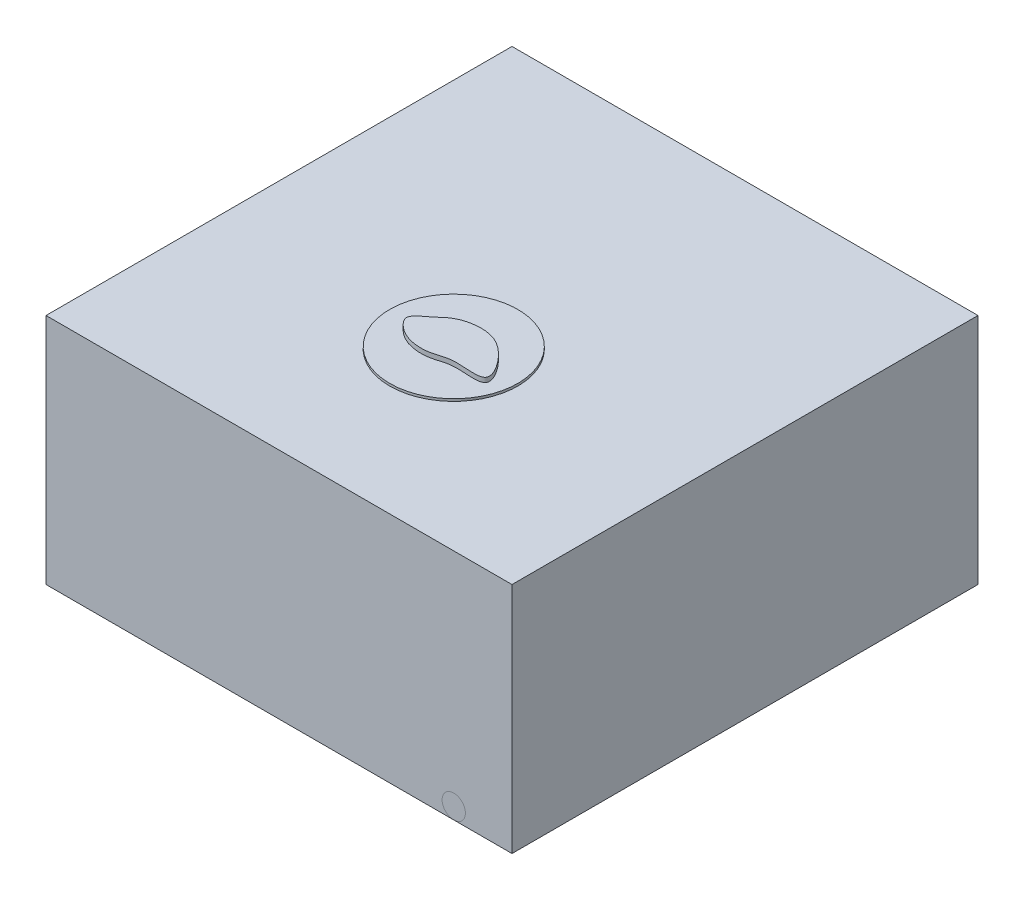
ISO-10303-21;
HEADER;
FILE_DESCRIPTION(('STEP AP214'),'2;1');
FILE_NAME('part.step','',(''),(''),'','','');
FILE_SCHEMA(('AUTOMOTIVE_DESIGN { 1 0 10303 214 1 1 1 1 }'));
ENDSEC;
DATA;
#1=APPLICATION_CONTEXT('core data for automotive mechanical design processes');
#2=APPLICATION_PROTOCOL_DEFINITION('international standard','automotive_design',2000,#1);
#3=PRODUCT_CONTEXT('',#1,'mechanical');
#4=PRODUCT('Part','Part','',(#3));
#5=PRODUCT_RELATED_PRODUCT_CATEGORY('part','',(#4));
#6=PRODUCT_DEFINITION_FORMATION('','',#4);
#7=PRODUCT_DEFINITION_CONTEXT('part definition',#1,'design');
#8=PRODUCT_DEFINITION('design','',#6,#7);
#9=PRODUCT_DEFINITION_SHAPE('','',#8);
#10=(LENGTH_UNIT() NAMED_UNIT(*) SI_UNIT(.MILLI.,.METRE.));
#11=(NAMED_UNIT(*) PLANE_ANGLE_UNIT() SI_UNIT($,.RADIAN.));
#12=(NAMED_UNIT(*) SI_UNIT($,.STERADIAN.) SOLID_ANGLE_UNIT());
#13=UNCERTAINTY_MEASURE_WITH_UNIT(LENGTH_MEASURE(1.E-05),#10,'distance_accuracy_value','');
#14=(GEOMETRIC_REPRESENTATION_CONTEXT(3) GLOBAL_UNCERTAINTY_ASSIGNED_CONTEXT((#13)) GLOBAL_UNIT_ASSIGNED_CONTEXT((#10,
#11,#12)) REPRESENTATION_CONTEXT('',''));
#15=CARTESIAN_POINT('',(0.,0.,0.));
#16=DIRECTION('',(0.,0.,1.));
#17=DIRECTION('',(1.,0.,0.));
#18=AXIS2_PLACEMENT_3D('',#15,#16,#17);
#19=CARTESIAN_POINT('',(-1.32978682457797,5.3,12.0470966404881));
#20=CARTESIAN_POINT('',(-1.56949938233388,5.3,12.2405123536894));
#21=CARTESIAN_POINT('',(-2.08614424851907,5.3,12.5391697720833));
#22=CARTESIAN_POINT('',(-1.58643209411403,5.3,13.1168891119311));
#23=CARTESIAN_POINT('',(-0.99479110722871,5.3,13.4609601521511));
#24=CARTESIAN_POINT('',(-0.122057096544853,5.3,13.5063472457396));
#25=CARTESIAN_POINT('',(0.780549472015395,5.3,13.1044677868928));
#26=CARTESIAN_POINT('',(2.65290980881673,5.3,13.5718372621998));
#27=CARTESIAN_POINT('',(1.37260667116618,5.3,11.7465735610997));
#28=CARTESIAN_POINT('',(0.251281573482777,5.3,11.3225744749199));
#29=CARTESIAN_POINT('',(-0.824147776626976,5.3,11.5489578340658));
#30=CARTESIAN_POINT('',(-1.19634203116918,5.3,11.9394246848268));
#31=CARTESIAN_POINT('',(-1.32978682457797,5.3,12.0470966404881));
#32=B_SPLINE_CURVE_WITH_KNOTS('',3,(#19,#20,#21,#22,#23,#24,#25,#26,#27,#28,#29,#30,#31),
.UNSPECIFIED.,.T.,.F.,(4,1,1,1,1,1,1,1,1,1,4),(0.,0.0890314863366276,0.133435272323839,
0.204833870138696,0.315562123210451,0.38661889368764,0.538438655581061,0.696738525235763,
0.817182112999442,0.95043735542146,1.),.UNSPECIFIED.);
#33=DIRECTION('',(0.,-1.,0.));
#34=VECTOR('',#33,1.);
#35=SURFACE_OF_LINEAR_EXTRUSION('',#32,#34);
#36=CARTESIAN_POINT('',(-1.32978682457797,5.3,12.0470966404881));
#37=VERTEX_POINT('',#36);
#38=EDGE_CURVE('E11',#37,#37,#32,.T.);
#39=ORIENTED_EDGE('',*,*,#38,.F.);
#40=EDGE_LOOP('',(#39));
#41=FACE_BOUND('',#40,.T.);
#42=CARTESIAN_POINT('',(-1.32978682457797,5.,12.0470966404881));
#43=CARTESIAN_POINT('',(-1.56949938233388,5.,12.2405123536894));
#44=CARTESIAN_POINT('',(-2.08614424851907,5.,12.5391697720833));
#45=CARTESIAN_POINT('',(-1.58643209411403,5.,13.1168891119311));
#46=CARTESIAN_POINT('',(-0.99479110722871,5.,13.4609601521511));
#47=CARTESIAN_POINT('',(-0.122057096544853,5.,13.5063472457396));
#48=CARTESIAN_POINT('',(0.780549472015395,5.,13.1044677868928));
#49=CARTESIAN_POINT('',(2.65290980881673,5.,13.5718372621998));
#50=CARTESIAN_POINT('',(1.37260667116618,5.,11.7465735610997));
#51=CARTESIAN_POINT('',(0.251281573482777,5.,11.3225744749199));
#52=CARTESIAN_POINT('',(-0.824147776626976,5.,11.5489578340658));
#53=CARTESIAN_POINT('',(-1.19634203116918,5.,11.9394246848268));
#54=CARTESIAN_POINT('',(-1.32978682457797,5.,12.0470966404881));
#55=B_SPLINE_CURVE_WITH_KNOTS('',3,(#42,#43,#44,#45,#46,#47,#48,#49,#50,#51,#52,#53,#54),
.UNSPECIFIED.,.T.,.F.,(4,1,1,1,1,1,1,1,1,1,4),(0.,0.0890314863366276,0.133435272323839,
0.204833870138696,0.315562123210451,0.38661889368764,0.538438655581061,0.696738525235763,
0.817182112999442,0.95043735542146,1.),.UNSPECIFIED.);
#56=CARTESIAN_POINT('',(-1.32978682457797,5.,12.0470966404881));
#57=VERTEX_POINT('',#56);
#58=EDGE_CURVE('E45',#57,#57,#55,.T.);
#59=ORIENTED_EDGE('',*,*,#58,.T.);
#60=EDGE_LOOP('',(#59));
#61=FACE_BOUND('',#60,.T.);
#62=ADVANCED_FACE('F41',(#41,#61),#35,.F.);
#63=CARTESIAN_POINT('',(1.81422588975815,5.3,13.257386496687));
#64=DIRECTION('',(0.,-1.,0.));
#65=DIRECTION('',(0.,0.,-1.));
#66=AXIS2_PLACEMENT_3D('',#63,#64,#65);
#67=PLANE('',#66);
#68=ORIENTED_EDGE('',*,*,#38,.T.);
#69=EDGE_LOOP('',(#68));
#70=FACE_BOUND('',#69,.T.);
#71=ADVANCED_FACE('F64',(#70),#67,.F.);
#72=CARTESIAN_POINT('',(1.81422588975815,5.,13.257386496687));
#73=DIRECTION('',(0.,-1.,0.));
#74=DIRECTION('',(0.,0.,-1.));
#75=AXIS2_PLACEMENT_3D('',#72,#73,#74);
#76=PLANE('',#75);
#77=ORIENTED_EDGE('',*,*,#58,.F.);
#78=EDGE_LOOP('',(#77));
#79=FACE_BOUND('',#78,.T.);
#80=ADVANCED_FACE('F62',(#79),#76,.T.);
#81=CLOSED_SHELL('',(#62,#71,#80));
#82=MANIFOLD_SOLID_BREP('B2',#81);
#83=CARTESIAN_POINT('',(0.5,5.,12.5));
#84=DIRECTION('',(0.,1.,0.));
#85=DIRECTION('',(0.,0.,1.));
#86=AXIS2_PLACEMENT_3D('',#83,#84,#85);
#87=CYLINDRICAL_SURFACE('',#86,0.00500000000000103);
#88=CARTESIAN_POINT('',(0.5,5.,12.5));
#89=DIRECTION('',(0.,-1.,0.));
#90=DIRECTION('',(0.,0.,1.));
#91=AXIS2_PLACEMENT_3D('',#88,#89,#90);
#92=CIRCLE('',#91,0.00500000000000103);
#93=CARTESIAN_POINT('',(0.5,5.,12.505));
#94=VERTEX_POINT('',#93);
#95=EDGE_CURVE('E40',#94,#94,#92,.T.);
#96=ORIENTED_EDGE('',*,*,#95,.F.);
#97=EDGE_LOOP('',(#96));
#98=FACE_BOUND('',#97,.T.);
#99=CARTESIAN_POINT('',(0.5,5.1,12.5));
#100=DIRECTION('',(0.,-1.,0.));
#101=DIRECTION('',(0.,0.,1.));
#102=AXIS2_PLACEMENT_3D('',#99,#100,#101);
#103=CIRCLE('',#102,0.00500000000000103);
#104=CARTESIAN_POINT('',(0.5,5.1,12.505));
#105=VERTEX_POINT('',#104);
#106=EDGE_CURVE('E103',#105,#105,#103,.T.);
#107=ORIENTED_EDGE('',*,*,#106,.T.);
#108=EDGE_LOOP('',(#107));
#109=FACE_BOUND('',#108,.T.);
#110=ADVANCED_FACE('F100',(#98,#109),#87,.T.);
#111=CARTESIAN_POINT('',(0.5,5.,12.5));
#112=DIRECTION('',(0.,1.,0.));
#113=DIRECTION('',(0.,0.,1.));
#114=AXIS2_PLACEMENT_3D('',#111,#112,#113);
#115=PLANE('',#114);
#116=ORIENTED_EDGE('',*,*,#95,.T.);
#117=EDGE_LOOP('',(#116));
#118=FACE_BOUND('',#117,.T.);
#119=ADVANCED_FACE('F115',(#118),#115,.F.);
#120=CARTESIAN_POINT('',(0.5,5.1,12.5));
#121=DIRECTION('',(0.,1.,0.));
#122=DIRECTION('',(0.,0.,1.));
#123=AXIS2_PLACEMENT_3D('',#120,#121,#122);
#124=PLANE('',#123);
#125=ORIENTED_EDGE('',*,*,#106,.F.);
#126=EDGE_LOOP('',(#125));
#127=FACE_BOUND('',#126,.T.);
#128=ADVANCED_FACE('F113',(#127),#124,.T.);
#129=CLOSED_SHELL('',(#110,#119,#128));
#130=MANIFOLD_SOLID_BREP('B6_NOT_SHOWN',#129);
#131=CARTESIAN_POINT('',(0.499999999999998,5.,12.));
#132=DIRECTION('',(0.,1.,0.));
#133=DIRECTION('',(0.,0.,1.));
#134=AXIS2_PLACEMENT_3D('',#131,#132,#133);
#135=CYLINDRICAL_SURFACE('',#134,0.00499999999999896);
#136=CARTESIAN_POINT('',(0.499999999999998,5.,12.));
#137=DIRECTION('',(0.,-1.,0.));
#138=DIRECTION('',(0.,0.,1.));
#139=AXIS2_PLACEMENT_3D('',#136,#137,#138);
#140=CIRCLE('',#139,0.00499999999999896);
#141=CARTESIAN_POINT('',(0.499999999999998,5.,12.005));
#142=VERTEX_POINT('',#141);
#143=EDGE_CURVE('E99',#142,#142,#140,.T.);
#144=ORIENTED_EDGE('',*,*,#143,.F.);
#145=EDGE_LOOP('',(#144));
#146=FACE_BOUND('',#145,.T.);
#147=CARTESIAN_POINT('',(0.499999999999998,5.1,12.));
#148=DIRECTION('',(0.,-1.,0.));
#149=DIRECTION('',(0.,0.,1.));
#150=AXIS2_PLACEMENT_3D('',#147,#148,#149);
#151=CIRCLE('',#150,0.00499999999999896);
#152=CARTESIAN_POINT('',(0.499999999999998,5.1,12.005));
#153=VERTEX_POINT('',#152);
#154=EDGE_CURVE('E151',#153,#153,#151,.T.);
#155=ORIENTED_EDGE('',*,*,#154,.T.);
#156=EDGE_LOOP('',(#155));
#157=FACE_BOUND('',#156,.T.);
#158=ADVANCED_FACE('F148',(#146,#157),#135,.T.);
#159=CARTESIAN_POINT('',(0.499999999999998,5.,12.));
#160=DIRECTION('',(0.,1.,0.));
#161=DIRECTION('',(0.,0.,1.));
#162=AXIS2_PLACEMENT_3D('',#159,#160,#161);
#163=PLANE('',#162);
#164=ORIENTED_EDGE('',*,*,#143,.T.);
#165=EDGE_LOOP('',(#164));
#166=FACE_BOUND('',#165,.T.);
#167=ADVANCED_FACE('F163',(#166),#163,.F.);
#168=CARTESIAN_POINT('',(0.499999999999998,5.1,12.));
#169=DIRECTION('',(0.,1.,0.));
#170=DIRECTION('',(0.,0.,1.));
#171=AXIS2_PLACEMENT_3D('',#168,#169,#170);
#172=PLANE('',#171);
#173=ORIENTED_EDGE('',*,*,#154,.F.);
#174=EDGE_LOOP('',(#173));
#175=FACE_BOUND('',#174,.T.);
#176=ADVANCED_FACE('F161',(#175),#172,.T.);
#177=CLOSED_SHELL('',(#158,#167,#176));
#178=MANIFOLD_SOLID_BREP('B35_NOT_SHOWN',#177);
#179=CARTESIAN_POINT('',(0.499999999999998,5.,13.));
#180=DIRECTION('',(0.,1.,0.));
#181=DIRECTION('',(0.,0.,1.));
#182=AXIS2_PLACEMENT_3D('',#179,#180,#181);
#183=CYLINDRICAL_SURFACE('',#182,0.00500000000000103);
#184=CARTESIAN_POINT('',(0.499999999999998,5.,13.));
#185=DIRECTION('',(0.,-1.,0.));
#186=DIRECTION('',(0.,0.,-1.));
#187=AXIS2_PLACEMENT_3D('',#184,#185,#186);
#188=CIRCLE('',#187,0.00500000000000103);
#189=CARTESIAN_POINT('',(0.499999999999998,5.,12.995));
#190=VERTEX_POINT('',#189);
#191=EDGE_CURVE('E147',#190,#190,#188,.T.);
#192=ORIENTED_EDGE('',*,*,#191,.F.);
#193=EDGE_LOOP('',(#192));
#194=FACE_BOUND('',#193,.T.);
#195=CARTESIAN_POINT('',(0.499999999999998,5.1,13.));
#196=DIRECTION('',(0.,-1.,0.));
#197=DIRECTION('',(0.,0.,-1.));
#198=AXIS2_PLACEMENT_3D('',#195,#196,#197);
#199=CIRCLE('',#198,0.00500000000000103);
#200=CARTESIAN_POINT('',(0.499999999999998,5.1,12.995));
#201=VERTEX_POINT('',#200);
#202=EDGE_CURVE('E199',#201,#201,#199,.T.);
#203=ORIENTED_EDGE('',*,*,#202,.T.);
#204=EDGE_LOOP('',(#203));
#205=FACE_BOUND('',#204,.T.);
#206=ADVANCED_FACE('F196',(#194,#205),#183,.T.);
#207=CARTESIAN_POINT('',(0.499999999999998,5.,13.));
#208=DIRECTION('',(0.,-1.,0.));
#209=DIRECTION('',(0.,0.,-1.));
#210=AXIS2_PLACEMENT_3D('',#207,#208,#209);
#211=PLANE('',#210);
#212=ORIENTED_EDGE('',*,*,#191,.T.);
#213=EDGE_LOOP('',(#212));
#214=FACE_BOUND('',#213,.T.);
#215=ADVANCED_FACE('F211',(#214),#211,.T.);
#216=CARTESIAN_POINT('',(0.499999999999998,5.1,13.));
#217=DIRECTION('',(0.,-1.,0.));
#218=DIRECTION('',(0.,0.,-1.));
#219=AXIS2_PLACEMENT_3D('',#216,#217,#218);
#220=PLANE('',#219);
#221=ORIENTED_EDGE('',*,*,#202,.F.);
#222=EDGE_LOOP('',(#221));
#223=FACE_BOUND('',#222,.T.);
#224=ADVANCED_FACE('F209',(#223),#220,.F.);
#225=CLOSED_SHELL('',(#206,#215,#224));
#226=MANIFOLD_SOLID_BREP('B94_NOT_SHOWN',#225);
#227=CARTESIAN_POINT('',(0.,5.,13.));
#228=DIRECTION('',(0.,1.,0.));
#229=DIRECTION('',(0.,0.,1.));
#230=AXIS2_PLACEMENT_3D('',#227,#228,#229);
#231=CYLINDRICAL_SURFACE('',#230,0.00500000000000099);
#232=CARTESIAN_POINT('',(0.,5.,13.));
#233=DIRECTION('',(0.,-1.,0.));
#234=DIRECTION('',(0.,0.,1.));
#235=AXIS2_PLACEMENT_3D('',#232,#233,#234);
#236=CIRCLE('',#235,0.00500000000000099);
#237=CARTESIAN_POINT('',(0.,5.,13.005));
#238=VERTEX_POINT('',#237);
#239=EDGE_CURVE('E195',#238,#238,#236,.T.);
#240=ORIENTED_EDGE('',*,*,#239,.F.);
#241=EDGE_LOOP('',(#240));
#242=FACE_BOUND('',#241,.T.);
#243=CARTESIAN_POINT('',(0.,5.1,13.));
#244=DIRECTION('',(0.,-1.,0.));
#245=DIRECTION('',(0.,0.,1.));
#246=AXIS2_PLACEMENT_3D('',#243,#244,#245);
#247=CIRCLE('',#246,0.00500000000000099);
#248=CARTESIAN_POINT('',(0.,5.1,13.005));
#249=VERTEX_POINT('',#248);
#250=EDGE_CURVE('E247',#249,#249,#247,.T.);
#251=ORIENTED_EDGE('',*,*,#250,.T.);
#252=EDGE_LOOP('',(#251));
#253=FACE_BOUND('',#252,.T.);
#254=ADVANCED_FACE('F244',(#242,#253),#231,.T.);
#255=CARTESIAN_POINT('',(0.,5.,13.));
#256=DIRECTION('',(0.,1.,0.));
#257=DIRECTION('',(0.,0.,1.));
#258=AXIS2_PLACEMENT_3D('',#255,#256,#257);
#259=PLANE('',#258);
#260=ORIENTED_EDGE('',*,*,#239,.T.);
#261=EDGE_LOOP('',(#260));
#262=FACE_BOUND('',#261,.T.);
#263=ADVANCED_FACE('F259',(#262),#259,.F.);
#264=CARTESIAN_POINT('',(0.,5.1,13.));
#265=DIRECTION('',(0.,1.,0.));
#266=DIRECTION('',(0.,0.,1.));
#267=AXIS2_PLACEMENT_3D('',#264,#265,#266);
#268=PLANE('',#267);
#269=ORIENTED_EDGE('',*,*,#250,.F.);
#270=EDGE_LOOP('',(#269));
#271=FACE_BOUND('',#270,.T.);
#272=ADVANCED_FACE('F257',(#271),#268,.T.);
#273=CLOSED_SHELL('',(#254,#263,#272));
#274=MANIFOLD_SOLID_BREP('B142_NOT_SHOWN',#273);
#275=CARTESIAN_POINT('',(-0.499999999999998,5.,13.));
#276=DIRECTION('',(0.,1.,0.));
#277=DIRECTION('',(0.,0.,1.));
#278=AXIS2_PLACEMENT_3D('',#275,#276,#277);
#279=CYLINDRICAL_SURFACE('',#278,0.00500000000000103);
#280=CARTESIAN_POINT('',(-0.499999999999998,5.,13.));
#281=DIRECTION('',(0.,-1.,0.));
#282=DIRECTION('',(0.,0.,1.));
#283=AXIS2_PLACEMENT_3D('',#280,#281,#282);
#284=CIRCLE('',#283,0.00500000000000103);
#285=CARTESIAN_POINT('',(-0.499999999999998,5.,13.005));
#286=VERTEX_POINT('',#285);
#287=EDGE_CURVE('E243',#286,#286,#284,.T.);
#288=ORIENTED_EDGE('',*,*,#287,.F.);
#289=EDGE_LOOP('',(#288));
#290=FACE_BOUND('',#289,.T.);
#291=CARTESIAN_POINT('',(-0.499999999999998,5.1,13.));
#292=DIRECTION('',(0.,-1.,0.));
#293=DIRECTION('',(0.,0.,1.));
#294=AXIS2_PLACEMENT_3D('',#291,#292,#293);
#295=CIRCLE('',#294,0.00500000000000103);
#296=CARTESIAN_POINT('',(-0.499999999999998,5.1,13.005));
#297=VERTEX_POINT('',#296);
#298=EDGE_CURVE('E295',#297,#297,#295,.T.);
#299=ORIENTED_EDGE('',*,*,#298,.T.);
#300=EDGE_LOOP('',(#299));
#301=FACE_BOUND('',#300,.T.);
#302=ADVANCED_FACE('F292',(#290,#301),#279,.T.);
#303=CARTESIAN_POINT('',(-0.499999999999998,5.,13.));
#304=DIRECTION('',(0.,1.,0.));
#305=DIRECTION('',(0.,0.,1.));
#306=AXIS2_PLACEMENT_3D('',#303,#304,#305);
#307=PLANE('',#306);
#308=ORIENTED_EDGE('',*,*,#287,.T.);
#309=EDGE_LOOP('',(#308));
#310=FACE_BOUND('',#309,.T.);
#311=ADVANCED_FACE('F307',(#310),#307,.F.);
#312=CARTESIAN_POINT('',(-0.499999999999998,5.1,13.));
#313=DIRECTION('',(0.,1.,0.));
#314=DIRECTION('',(0.,0.,1.));
#315=AXIS2_PLACEMENT_3D('',#312,#313,#314);
#316=PLANE('',#315);
#317=ORIENTED_EDGE('',*,*,#298,.F.);
#318=EDGE_LOOP('',(#317));
#319=FACE_BOUND('',#318,.T.);
#320=ADVANCED_FACE('F305',(#319),#316,.T.);
#321=CLOSED_SHELL('',(#302,#311,#320));
#322=MANIFOLD_SOLID_BREP('B190_NOT_SHOWN',#321);
#323=CARTESIAN_POINT('',(0.,5.,12.));
#324=DIRECTION('',(0.,1.,0.));
#325=DIRECTION('',(0.,0.,1.));
#326=AXIS2_PLACEMENT_3D('',#323,#324,#325);
#327=CYLINDRICAL_SURFACE('',#326,0.00499999999999898);
#328=CARTESIAN_POINT('',(0.,5.,12.));
#329=DIRECTION('',(0.,-1.,0.));
#330=DIRECTION('',(0.,0.,-1.));
#331=AXIS2_PLACEMENT_3D('',#328,#329,#330);
#332=CIRCLE('',#331,0.00499999999999898);
#333=CARTESIAN_POINT('',(0.,5.,11.995));
#334=VERTEX_POINT('',#333);
#335=EDGE_CURVE('E291',#334,#334,#332,.T.);
#336=ORIENTED_EDGE('',*,*,#335,.F.);
#337=EDGE_LOOP('',(#336));
#338=FACE_BOUND('',#337,.T.);
#339=CARTESIAN_POINT('',(0.,5.1,12.));
#340=DIRECTION('',(0.,-1.,0.));
#341=DIRECTION('',(0.,0.,-1.));
#342=AXIS2_PLACEMENT_3D('',#339,#340,#341);
#343=CIRCLE('',#342,0.00499999999999898);
#344=CARTESIAN_POINT('',(0.,5.1,11.995));
#345=VERTEX_POINT('',#344);
#346=EDGE_CURVE('E343',#345,#345,#343,.T.);
#347=ORIENTED_EDGE('',*,*,#346,.T.);
#348=EDGE_LOOP('',(#347));
#349=FACE_BOUND('',#348,.T.);
#350=ADVANCED_FACE('F340',(#338,#349),#327,.T.);
#351=CARTESIAN_POINT('',(0.,5.,12.));
#352=DIRECTION('',(0.,-1.,0.));
#353=DIRECTION('',(0.,0.,-1.));
#354=AXIS2_PLACEMENT_3D('',#351,#352,#353);
#355=PLANE('',#354);
#356=ORIENTED_EDGE('',*,*,#335,.T.);
#357=EDGE_LOOP('',(#356));
#358=FACE_BOUND('',#357,.T.);
#359=ADVANCED_FACE('F355',(#358),#355,.T.);
#360=CARTESIAN_POINT('',(0.,5.1,12.));
#361=DIRECTION('',(0.,-1.,0.));
#362=DIRECTION('',(0.,0.,-1.));
#363=AXIS2_PLACEMENT_3D('',#360,#361,#362);
#364=PLANE('',#363);
#365=ORIENTED_EDGE('',*,*,#346,.F.);
#366=EDGE_LOOP('',(#365));
#367=FACE_BOUND('',#366,.T.);
#368=ADVANCED_FACE('F353',(#367),#364,.F.);
#369=CLOSED_SHELL('',(#350,#359,#368));
#370=MANIFOLD_SOLID_BREP('B238_NOT_SHOWN',#369);
#371=CARTESIAN_POINT('',(-0.499999999999998,5.,12.));
#372=DIRECTION('',(0.,1.,0.));
#373=DIRECTION('',(0.,0.,1.));
#374=AXIS2_PLACEMENT_3D('',#371,#372,#373);
#375=CYLINDRICAL_SURFACE('',#374,0.00499999999999896);
#376=CARTESIAN_POINT('',(-0.499999999999998,5.,12.));
#377=DIRECTION('',(0.,-1.,0.));
#378=DIRECTION('',(0.,0.,-1.));
#379=AXIS2_PLACEMENT_3D('',#376,#377,#378);
#380=CIRCLE('',#379,0.00499999999999896);
#381=CARTESIAN_POINT('',(-0.499999999999998,5.,11.995));
#382=VERTEX_POINT('',#381);
#383=EDGE_CURVE('E339',#382,#382,#380,.T.);
#384=ORIENTED_EDGE('',*,*,#383,.F.);
#385=EDGE_LOOP('',(#384));
#386=FACE_BOUND('',#385,.T.);
#387=CARTESIAN_POINT('',(-0.499999999999998,5.1,12.));
#388=DIRECTION('',(0.,-1.,0.));
#389=DIRECTION('',(0.,0.,-1.));
#390=AXIS2_PLACEMENT_3D('',#387,#388,#389);
#391=CIRCLE('',#390,0.00499999999999896);
#392=CARTESIAN_POINT('',(-0.499999999999998,5.1,11.995));
#393=VERTEX_POINT('',#392);
#394=EDGE_CURVE('E391',#393,#393,#391,.T.);
#395=ORIENTED_EDGE('',*,*,#394,.T.);
#396=EDGE_LOOP('',(#395));
#397=FACE_BOUND('',#396,.T.);
#398=ADVANCED_FACE('F388',(#386,#397),#375,.T.);
#399=CARTESIAN_POINT('',(-0.499999999999998,5.,12.));
#400=DIRECTION('',(0.,-1.,0.));
#401=DIRECTION('',(0.,0.,-1.));
#402=AXIS2_PLACEMENT_3D('',#399,#400,#401);
#403=PLANE('',#402);
#404=ORIENTED_EDGE('',*,*,#383,.T.);
#405=EDGE_LOOP('',(#404));
#406=FACE_BOUND('',#405,.T.);
#407=ADVANCED_FACE('F403',(#406),#403,.T.);
#408=CARTESIAN_POINT('',(-0.499999999999998,5.1,12.));
#409=DIRECTION('',(0.,-1.,0.));
#410=DIRECTION('',(0.,0.,-1.));
#411=AXIS2_PLACEMENT_3D('',#408,#409,#410);
#412=PLANE('',#411);
#413=ORIENTED_EDGE('',*,*,#394,.F.);
#414=EDGE_LOOP('',(#413));
#415=FACE_BOUND('',#414,.T.);
#416=ADVANCED_FACE('F401',(#415),#412,.F.);
#417=CLOSED_SHELL('',(#398,#407,#416));
#418=MANIFOLD_SOLID_BREP('B286_NOT_SHOWN',#417);
#419=CARTESIAN_POINT('',(-0.5,5.,12.5));
#420=DIRECTION('',(0.,1.,0.));
#421=DIRECTION('',(0.,0.,1.));
#422=AXIS2_PLACEMENT_3D('',#419,#420,#421);
#423=CYLINDRICAL_SURFACE('',#422,0.00500000000000103);
#424=CARTESIAN_POINT('',(-0.5,5.,12.5));
#425=DIRECTION('',(0.,-1.,0.));
#426=DIRECTION('',(0.,0.,-1.));
#427=AXIS2_PLACEMENT_3D('',#424,#425,#426);
#428=CIRCLE('',#427,0.00500000000000103);
#429=CARTESIAN_POINT('',(-0.5,5.,12.495));
#430=VERTEX_POINT('',#429);
#431=EDGE_CURVE('E387',#430,#430,#428,.T.);
#432=ORIENTED_EDGE('',*,*,#431,.F.);
#433=EDGE_LOOP('',(#432));
#434=FACE_BOUND('',#433,.T.);
#435=CARTESIAN_POINT('',(-0.5,5.1,12.5));
#436=DIRECTION('',(0.,-1.,0.));
#437=DIRECTION('',(0.,0.,-1.));
#438=AXIS2_PLACEMENT_3D('',#435,#436,#437);
#439=CIRCLE('',#438,0.00500000000000103);
#440=CARTESIAN_POINT('',(-0.5,5.1,12.495));
#441=VERTEX_POINT('',#440);
#442=EDGE_CURVE('E439',#441,#441,#439,.T.);
#443=ORIENTED_EDGE('',*,*,#442,.T.);
#444=EDGE_LOOP('',(#443));
#445=FACE_BOUND('',#444,.T.);
#446=ADVANCED_FACE('F436',(#434,#445),#423,.T.);
#447=CARTESIAN_POINT('',(-0.5,5.,12.5));
#448=DIRECTION('',(0.,-1.,0.));
#449=DIRECTION('',(0.,0.,-1.));
#450=AXIS2_PLACEMENT_3D('',#447,#448,#449);
#451=PLANE('',#450);
#452=ORIENTED_EDGE('',*,*,#431,.T.);
#453=EDGE_LOOP('',(#452));
#454=FACE_BOUND('',#453,.T.);
#455=ADVANCED_FACE('F451',(#454),#451,.T.);
#456=CARTESIAN_POINT('',(-0.5,5.1,12.5));
#457=DIRECTION('',(0.,-1.,0.));
#458=DIRECTION('',(0.,0.,-1.));
#459=AXIS2_PLACEMENT_3D('',#456,#457,#458);
#460=PLANE('',#459);
#461=ORIENTED_EDGE('',*,*,#442,.F.);
#462=EDGE_LOOP('',(#461));
#463=FACE_BOUND('',#462,.T.);
#464=ADVANCED_FACE('F449',(#463),#460,.F.);
#465=CLOSED_SHELL('',(#446,#455,#464));
#466=MANIFOLD_SOLID_BREP('B334_NOT_SHOWN',#465);
#467=CARTESIAN_POINT('',(0.,5.,12.5));
#468=DIRECTION('',(0.,1.,0.));
#469=DIRECTION('',(0.,0.,1.));
#470=AXIS2_PLACEMENT_3D('',#467,#468,#469);
#471=CYLINDRICAL_SURFACE('',#470,0.00500000000000099);
#472=CARTESIAN_POINT('',(0.,5.,12.5));
#473=DIRECTION('',(0.,-1.,0.));
#474=DIRECTION('',(0.,0.,-1.));
#475=AXIS2_PLACEMENT_3D('',#472,#473,#474);
#476=CIRCLE('',#475,0.00500000000000099);
#477=CARTESIAN_POINT('',(0.,5.,12.495));
#478=VERTEX_POINT('',#477);
#479=EDGE_CURVE('E435',#478,#478,#476,.T.);
#480=ORIENTED_EDGE('',*,*,#479,.F.);
#481=EDGE_LOOP('',(#480));
#482=FACE_BOUND('',#481,.T.);
#483=CARTESIAN_POINT('',(0.,5.1,12.5));
#484=DIRECTION('',(0.,-1.,0.));
#485=DIRECTION('',(0.,0.,-1.));
#486=AXIS2_PLACEMENT_3D('',#483,#484,#485);
#487=CIRCLE('',#486,0.00500000000000099);
#488=CARTESIAN_POINT('',(0.,5.1,12.495));
#489=VERTEX_POINT('',#488);
#490=EDGE_CURVE('E487',#489,#489,#487,.T.);
#491=ORIENTED_EDGE('',*,*,#490,.T.);
#492=EDGE_LOOP('',(#491));
#493=FACE_BOUND('',#492,.T.);
#494=ADVANCED_FACE('F484',(#482,#493),#471,.T.);
#495=CARTESIAN_POINT('',(0.,5.,12.5));
#496=DIRECTION('',(0.,-1.,0.));
#497=DIRECTION('',(0.,0.,-1.));
#498=AXIS2_PLACEMENT_3D('',#495,#496,#497);
#499=PLANE('',#498);
#500=ORIENTED_EDGE('',*,*,#479,.T.);
#501=EDGE_LOOP('',(#500));
#502=FACE_BOUND('',#501,.T.);
#503=ADVANCED_FACE('F499',(#502),#499,.T.);
#504=CARTESIAN_POINT('',(0.,5.1,12.5));
#505=DIRECTION('',(0.,-1.,0.));
#506=DIRECTION('',(0.,0.,-1.));
#507=AXIS2_PLACEMENT_3D('',#504,#505,#506);
#508=PLANE('',#507);
#509=ORIENTED_EDGE('',*,*,#490,.F.);
#510=EDGE_LOOP('',(#509));
#511=FACE_BOUND('',#510,.T.);
#512=ADVANCED_FACE('F497',(#511),#508,.F.);
#513=CLOSED_SHELL('',(#494,#503,#512));
#514=MANIFOLD_SOLID_BREP('B382_NOT_SHOWN',#513);
#515=CARTESIAN_POINT('',(0.,5.1,12.5));
#516=DIRECTION('',(0.,-1.,0.));
#517=DIRECTION('',(0.,0.,-1.));
#518=AXIS2_PLACEMENT_3D('',#515,#516,#517);
#519=CYLINDRICAL_SURFACE('',#518,2.75);
#520=CARTESIAN_POINT('',(0.,5.1,12.5));
#521=DIRECTION('',(0.,1.,0.));
#522=DIRECTION('',(0.,0.,1.));
#523=AXIS2_PLACEMENT_3D('',#520,#521,#522);
#524=CIRCLE('',#523,2.75);
#525=CARTESIAN_POINT('',(0.,5.1,15.25));
#526=VERTEX_POINT('',#525);
#527=EDGE_CURVE('E483',#526,#526,#524,.T.);
#528=ORIENTED_EDGE('',*,*,#527,.F.);
#529=EDGE_LOOP('',(#528));
#530=FACE_BOUND('',#529,.T.);
#531=CARTESIAN_POINT('',(0.,5.,12.5));
#532=DIRECTION('',(0.,1.,0.));
#533=DIRECTION('',(0.,0.,1.));
#534=AXIS2_PLACEMENT_3D('',#531,#532,#533);
#535=CIRCLE('',#534,2.75);
#536=CARTESIAN_POINT('',(0.,5.,15.25));
#537=VERTEX_POINT('',#536);
#538=EDGE_CURVE('E535',#537,#537,#535,.T.);
#539=ORIENTED_EDGE('',*,*,#538,.T.);
#540=EDGE_LOOP('',(#539));
#541=FACE_BOUND('',#540,.T.);
#542=ADVANCED_FACE('F532',(#530,#541),#519,.T.);
#543=CARTESIAN_POINT('',(0.,5.1,12.5));
#544=DIRECTION('',(0.,1.,0.));
#545=DIRECTION('',(0.,0.,1.));
#546=AXIS2_PLACEMENT_3D('',#543,#544,#545);
#547=PLANE('',#546);
#548=ORIENTED_EDGE('',*,*,#527,.T.);
#549=EDGE_LOOP('',(#548));
#550=FACE_BOUND('',#549,.T.);
#551=ADVANCED_FACE('F547',(#550),#547,.T.);
#552=CARTESIAN_POINT('',(0.,5.,12.5));
#553=DIRECTION('',(0.,1.,0.));
#554=DIRECTION('',(0.,0.,1.));
#555=AXIS2_PLACEMENT_3D('',#552,#553,#554);
#556=PLANE('',#555);
#557=ORIENTED_EDGE('',*,*,#538,.F.);
#558=EDGE_LOOP('',(#557));
#559=FACE_BOUND('',#558,.T.);
#560=ADVANCED_FACE('F545',(#559),#556,.F.);
#561=CLOSED_SHELL('',(#542,#551,#560));
#562=MANIFOLD_SOLID_BREP('B430_NOT_SHOWN',#561);
#563=CARTESIAN_POINT('',(7.5,-4.5,20.));
#564=DIRECTION('',(0.,0.,-1.));
#565=DIRECTION('',(-1.,0.,0.));
#566=AXIS2_PLACEMENT_3D('',#563,#564,#565);
#567=PLANE('',#566);
#568=CARTESIAN_POINT('',(7.5,-4.5,20.));
#569=DIRECTION('',(0.,0.,1.));
#570=DIRECTION('',(-1.,0.,0.));
#571=AXIS2_PLACEMENT_3D('',#568,#569,#570);
#572=CIRCLE('',#571,0.500000000000004);
#573=CARTESIAN_POINT('',(7.,-4.5,20.));
#574=VERTEX_POINT('',#573);
#575=EDGE_CURVE('E594',#574,#574,#572,.T.);
#576=ORIENTED_EDGE('',*,*,#575,.T.);
#577=EDGE_LOOP('',(#576));
#578=FACE_BOUND('',#577,.T.);
#579=ADVANCED_FACE('F580',(#578),#567,.F.);
#580=CARTESIAN_POINT('',(7.5,5.,4.));
#581=DIRECTION('',(0.,1.,0.));
#582=DIRECTION('',(-1.,0.,0.));
#583=AXIS2_PLACEMENT_3D('',#580,#581,#582);
#584=PLANE('',#583);
#585=CARTESIAN_POINT('',(7.5,5.,4.));
#586=DIRECTION('',(0.,-1.,0.));
#587=DIRECTION('',(-1.,0.,0.));
#588=AXIS2_PLACEMENT_3D('',#585,#586,#587);
#589=CIRCLE('',#588,0.500000000000004);
#590=CARTESIAN_POINT('',(7.,5.,4.));
#591=VERTEX_POINT('',#590);
#592=EDGE_CURVE('E531',#591,#591,#589,.T.);
#593=ORIENTED_EDGE('',*,*,#592,.F.);
#594=EDGE_LOOP('',(#593));
#595=FACE_BOUND('',#594,.T.);
#596=ADVANCED_FACE('F604',(#595),#584,.T.);
#597=CARTESIAN_POINT('',(7.5,-4.5,20.));
#598=DIRECTION('',(0.,0.,-1.));
#599=DIRECTION('',(-1.,0.,0.));
#600=AXIS2_PLACEMENT_3D('',#597,#598,#599);
#601=CYLINDRICAL_SURFACE('',#600,0.500000000000004);
#602=CARTESIAN_POINT('',(7.5,-4.5,5.));
#603=DIRECTION('',(0.,0.,1.));
#604=DIRECTION('',(-1.,0.,0.));
#605=AXIS2_PLACEMENT_3D('',#602,#603,#604);
#606=CIRCLE('',#605,0.500000000000004);
#607=CARTESIAN_POINT('',(7.5,-5.,5.));
#608=VERTEX_POINT('',#607);
#609=EDGE_CURVE('E590',#608,#608,#606,.T.);
#610=ORIENTED_EDGE('',*,*,#609,.T.);
#611=EDGE_LOOP('',(#610));
#612=FACE_BOUND('',#611,.T.);
#613=ORIENTED_EDGE('',*,*,#575,.F.);
#614=EDGE_LOOP('',(#613));
#615=FACE_BOUND('',#614,.T.);
#616=ADVANCED_FACE('F601',(#612,#615),#601,.T.);
#617=CARTESIAN_POINT('',(7.5,-3.5,5.));
#618=DIRECTION('',(1.,0.,0.));
#619=DIRECTION('',(0.,0.,-1.));
#620=AXIS2_PLACEMENT_3D('',#617,#618,#619);
#621=TOROIDAL_SURFACE('',#620,1.,0.500000000000004);
#622=CARTESIAN_POINT('',(7.5,-3.5,4.));
#623=DIRECTION('',(0.,-1.,0.));
#624=DIRECTION('',(-1.,0.,0.));
#625=AXIS2_PLACEMENT_3D('',#622,#623,#624);
#626=CIRCLE('',#625,0.500000000000004);
#627=CARTESIAN_POINT('',(7.5,-3.5,3.5));
#628=VERTEX_POINT('',#627);
#629=EDGE_CURVE('E586',#628,#628,#626,.T.);
#630=CARTESIAN_POINT('',(7.5,-3.5,5.));
#631=DIRECTION('',(1.,0.,0.));
#632=DIRECTION('',(0.,0.,-1.));
#633=AXIS2_PLACEMENT_3D('',#630,#631,#632);
#634=CIRCLE('',#633,1.5);
#635=EDGE_CURVE('',#608,#628,#634,.T.);
#636=ORIENTED_EDGE('',*,*,#609,.F.);
#637=ORIENTED_EDGE('',*,*,#629,.T.);
#638=ORIENTED_EDGE('',*,*,#635,.T.);
#639=ORIENTED_EDGE('',*,*,#635,.F.);
#640=EDGE_LOOP('',(#636,#638,#637,#639));
#641=FACE_BOUND('',#640,.T.);
#642=ADVANCED_FACE('F603',(#641),#621,.T.);
#643=CARTESIAN_POINT('',(7.5,-3.5,4.));
#644=DIRECTION('',(0.,1.,0.));
#645=DIRECTION('',(0.,0.,1.));
#646=AXIS2_PLACEMENT_3D('',#643,#644,#645);
#647=CYLINDRICAL_SURFACE('',#646,0.500000000000004);
#648=ORIENTED_EDGE('',*,*,#592,.T.);
#649=EDGE_LOOP('',(#648));
#650=FACE_BOUND('',#649,.T.);
#651=ORIENTED_EDGE('',*,*,#629,.F.);
#652=EDGE_LOOP('',(#651));
#653=FACE_BOUND('',#652,.T.);
#654=ADVANCED_FACE('F611',(#650,#653),#647,.T.);
#655=CLOSED_SHELL('',(#579,#596,#616,#642,#654));
#656=MANIFOLD_SOLID_BREP('B478',#655);
#657=CARTESIAN_POINT('',(-7.5,-4.5,20.));
#658=DIRECTION('',(0.,0.,1.));
#659=DIRECTION('',(1.,0.,0.));
#660=AXIS2_PLACEMENT_3D('',#657,#658,#659);
#661=PLANE('',#660);
#662=CARTESIAN_POINT('',(-7.5,-4.5,20.));
#663=DIRECTION('',(0.,0.,1.));
#664=DIRECTION('',(1.,0.,0.));
#665=AXIS2_PLACEMENT_3D('',#662,#663,#664);
#666=CIRCLE('',#665,0.500000000000002);
#667=CARTESIAN_POINT('',(-7.,-4.5,20.));
#668=VERTEX_POINT('',#667);
#669=EDGE_CURVE('E673',#668,#668,#666,.T.);
#670=ORIENTED_EDGE('',*,*,#669,.T.);
#671=EDGE_LOOP('',(#670));
#672=FACE_BOUND('',#671,.T.);
#673=ADVANCED_FACE('F659',(#672),#661,.T.);
#674=CARTESIAN_POINT('',(-7.5,5.,4.));
#675=DIRECTION('',(0.,-1.,0.));
#676=DIRECTION('',(1.,0.,0.));
#677=AXIS2_PLACEMENT_3D('',#674,#675,#676);
#678=PLANE('',#677);
#679=CARTESIAN_POINT('',(-7.5,5.,4.));
#680=DIRECTION('',(0.,-1.,0.));
#681=DIRECTION('',(1.,0.,0.));
#682=AXIS2_PLACEMENT_3D('',#679,#680,#681);
#683=CIRCLE('',#682,0.500000000000002);
#684=CARTESIAN_POINT('',(-7.,5.,4.));
#685=VERTEX_POINT('',#684);
#686=EDGE_CURVE('E579',#685,#685,#683,.T.);
#687=ORIENTED_EDGE('',*,*,#686,.F.);
#688=EDGE_LOOP('',(#687));
#689=FACE_BOUND('',#688,.T.);
#690=ADVANCED_FACE('F683',(#689),#678,.F.);
#691=CARTESIAN_POINT('',(-7.5,-4.5,20.));
#692=DIRECTION('',(0.,0.,-1.));
#693=DIRECTION('',(-1.,0.,0.));
#694=AXIS2_PLACEMENT_3D('',#691,#692,#693);
#695=CYLINDRICAL_SURFACE('',#694,0.500000000000002);
#696=CARTESIAN_POINT('',(-7.5,-4.5,5.));
#697=DIRECTION('',(0.,0.,1.));
#698=DIRECTION('',(1.,0.,0.));
#699=AXIS2_PLACEMENT_3D('',#696,#697,#698);
#700=CIRCLE('',#699,0.500000000000002);
#701=CARTESIAN_POINT('',(-7.5,-5.,5.));
#702=VERTEX_POINT('',#701);
#703=EDGE_CURVE('E669',#702,#702,#700,.T.);
#704=ORIENTED_EDGE('',*,*,#703,.T.);
#705=EDGE_LOOP('',(#704));
#706=FACE_BOUND('',#705,.T.);
#707=ORIENTED_EDGE('',*,*,#669,.F.);
#708=EDGE_LOOP('',(#707));
#709=FACE_BOUND('',#708,.T.);
#710=ADVANCED_FACE('F680',(#706,#709),#695,.T.);
#711=CARTESIAN_POINT('',(-7.5,-3.5,5.));
#712=DIRECTION('',(1.,0.,0.));
#713=DIRECTION('',(0.,0.,-1.));
#714=AXIS2_PLACEMENT_3D('',#711,#712,#713);
#715=TOROIDAL_SURFACE('',#714,1.,0.500000000000002);
#716=CARTESIAN_POINT('',(-7.5,-3.5,4.));
#717=DIRECTION('',(0.,-1.,0.));
#718=DIRECTION('',(1.,0.,0.));
#719=AXIS2_PLACEMENT_3D('',#716,#717,#718);
#720=CIRCLE('',#719,0.500000000000002);
#721=CARTESIAN_POINT('',(-7.5,-3.5,3.5));
#722=VERTEX_POINT('',#721);
#723=EDGE_CURVE('E665',#722,#722,#720,.T.);
#724=CARTESIAN_POINT('',(-7.5,-3.5,5.));
#725=DIRECTION('',(1.,0.,0.));
#726=DIRECTION('',(0.,0.,-1.));
#727=AXIS2_PLACEMENT_3D('',#724,#725,#726);
#728=CIRCLE('',#727,1.5);
#729=EDGE_CURVE('',#702,#722,#728,.T.);
#730=ORIENTED_EDGE('',*,*,#703,.F.);
#731=ORIENTED_EDGE('',*,*,#723,.T.);
#732=ORIENTED_EDGE('',*,*,#729,.T.);
#733=ORIENTED_EDGE('',*,*,#729,.F.);
#734=EDGE_LOOP('',(#730,#732,#731,#733));
#735=FACE_BOUND('',#734,.T.);
#736=ADVANCED_FACE('F682',(#735),#715,.T.);
#737=CARTESIAN_POINT('',(-7.5,-3.5,4.));
#738=DIRECTION('',(0.,1.,0.));
#739=DIRECTION('',(0.,0.,1.));
#740=AXIS2_PLACEMENT_3D('',#737,#738,#739);
#741=CYLINDRICAL_SURFACE('',#740,0.500000000000002);
#742=ORIENTED_EDGE('',*,*,#686,.T.);
#743=EDGE_LOOP('',(#742));
#744=FACE_BOUND('',#743,.T.);
#745=ORIENTED_EDGE('',*,*,#723,.F.);
#746=EDGE_LOOP('',(#745));
#747=FACE_BOUND('',#746,.T.);
#748=ADVANCED_FACE('F690',(#744,#747),#741,.T.);
#749=CLOSED_SHELL('',(#673,#690,#710,#736,#748));
#750=MANIFOLD_SOLID_BREP('B526',#749);
#751=CARTESIAN_POINT('',(10.,-5.,20.));
#752=DIRECTION('',(-1.,0.,0.));
#753=DIRECTION('',(0.,0.,1.));
#754=AXIS2_PLACEMENT_3D('',#751,#752,#753);
#755=PLANE('',#754);
#756=DIRECTION('',(0.,1.,0.));
#757=VECTOR('',#756,1.);
#758=CARTESIAN_POINT('',(10.,-5.,0.));
#759=LINE('',#758,#757);
#760=CARTESIAN_POINT('',(10.,-5.,0.));
#761=VERTEX_POINT('',#760);
#762=CARTESIAN_POINT('',(10.,5.,0.));
#763=VERTEX_POINT('',#762);
#764=EDGE_CURVE('E792',#761,#763,#759,.T.);
#765=ORIENTED_EDGE('',*,*,#764,.T.);
#766=DIRECTION('',(0.,0.,-1.));
#767=VECTOR('',#766,1.);
#768=CARTESIAN_POINT('',(10.,5.,20.));
#769=LINE('',#768,#767);
#770=CARTESIAN_POINT('',(10.,5.,20.));
#771=VERTEX_POINT('',#770);
#772=EDGE_CURVE('E657',#771,#763,#769,.T.);
#773=ORIENTED_EDGE('',*,*,#772,.F.);
#774=DIRECTION('',(0.,1.,0.));
#775=VECTOR('',#774,1.);
#776=CARTESIAN_POINT('',(10.,-5.,20.));
#777=LINE('',#776,#775);
#778=CARTESIAN_POINT('',(10.,-5.,20.));
#779=VERTEX_POINT('',#778);
#780=EDGE_CURVE('E780',#779,#771,#777,.T.);
#781=ORIENTED_EDGE('',*,*,#780,.F.);
#782=DIRECTION('',(0.,0.,-1.));
#783=VECTOR('',#782,1.);
#784=CARTESIAN_POINT('',(10.,-5.,20.));
#785=LINE('',#784,#783);
#786=EDGE_CURVE('E788',#779,#761,#785,.T.);
#787=ORIENTED_EDGE('',*,*,#786,.T.);
#788=EDGE_LOOP('',(#765,#773,#781,#787));
#789=FACE_BOUND('',#788,.T.);
#790=ADVANCED_FACE('F729',(#789),#755,.F.);
#791=CARTESIAN_POINT('',(-10.,5.,20.));
#792=DIRECTION('',(0.,-1.,0.));
#793=DIRECTION('',(0.,0.,-1.));
#794=AXIS2_PLACEMENT_3D('',#791,#792,#793);
#795=PLANE('',#794);
#796=DIRECTION('',(-1.,0.,0.));
#797=VECTOR('',#796,1.);
#798=CARTESIAN_POINT('',(-10.,5.,0.));
#799=LINE('',#798,#797);
#800=CARTESIAN_POINT('',(-10.,5.,0.));
#801=VERTEX_POINT('',#800);
#802=EDGE_CURVE('E784',#763,#801,#799,.T.);
#803=ORIENTED_EDGE('',*,*,#802,.T.);
#804=DIRECTION('',(0.,0.,-1.));
#805=VECTOR('',#804,1.);
#806=CARTESIAN_POINT('',(-10.,5.,20.));
#807=LINE('',#806,#805);
#808=CARTESIAN_POINT('',(-10.,5.,20.));
#809=VERTEX_POINT('',#808);
#810=EDGE_CURVE('E737',#809,#801,#807,.T.);
#811=ORIENTED_EDGE('',*,*,#810,.F.);
#812=DIRECTION('',(-1.,0.,0.));
#813=VECTOR('',#812,1.);
#814=CARTESIAN_POINT('',(-10.,5.,20.));
#815=LINE('',#814,#813);
#816=EDGE_CURVE('E775',#771,#809,#815,.T.);
#817=ORIENTED_EDGE('',*,*,#816,.F.);
#818=ORIENTED_EDGE('',*,*,#772,.T.);
#819=EDGE_LOOP('',(#803,#811,#817,#818));
#820=FACE_BOUND('',#819,.T.);
#821=ADVANCED_FACE('F783',(#820),#795,.F.);
#822=CARTESIAN_POINT('',(-10.,-5.,20.));
#823=DIRECTION('',(1.,0.,0.));
#824=DIRECTION('',(0.,1.,0.));
#825=AXIS2_PLACEMENT_3D('',#822,#823,#824);
#826=PLANE('',#825);
#827=DIRECTION('',(0.,-1.,0.));
#828=VECTOR('',#827,1.);
#829=CARTESIAN_POINT('',(-10.,-5.,0.));
#830=LINE('',#829,#828);
#831=CARTESIAN_POINT('',(-10.,-5.,0.));
#832=VERTEX_POINT('',#831);
#833=EDGE_CURVE('E762',#801,#832,#830,.T.);
#834=ORIENTED_EDGE('',*,*,#833,.T.);
#835=DIRECTION('',(0.,0.,-1.));
#836=VECTOR('',#835,1.);
#837=CARTESIAN_POINT('',(-10.,-5.,20.));
#838=LINE('',#837,#836);
#839=CARTESIAN_POINT('',(-10.,-5.,20.));
#840=VERTEX_POINT('',#839);
#841=EDGE_CURVE('E785',#840,#832,#838,.T.);
#842=ORIENTED_EDGE('',*,*,#841,.F.);
#843=DIRECTION('',(0.,-1.,0.));
#844=VECTOR('',#843,1.);
#845=CARTESIAN_POINT('',(-10.,-5.,20.));
#846=LINE('',#845,#844);
#847=EDGE_CURVE('E778',#809,#840,#846,.T.);
#848=ORIENTED_EDGE('',*,*,#847,.F.);
#849=ORIENTED_EDGE('',*,*,#810,.T.);
#850=EDGE_LOOP('',(#834,#842,#848,#849));
#851=FACE_BOUND('',#850,.T.);
#852=ADVANCED_FACE('F786',(#851),#826,.F.);
#853=CARTESIAN_POINT('',(-10.,-5.,20.));
#854=DIRECTION('',(0.,1.,0.));
#855=DIRECTION('',(0.,0.,1.));
#856=AXIS2_PLACEMENT_3D('',#853,#854,#855);
#857=PLANE('',#856);
#858=DIRECTION('',(1.,0.,0.));
#859=VECTOR('',#858,1.);
#860=CARTESIAN_POINT('',(-10.,-5.,0.));
#861=LINE('',#860,#859);
#862=EDGE_CURVE('E768',#832,#761,#861,.T.);
#863=ORIENTED_EDGE('',*,*,#862,.T.);
#864=ORIENTED_EDGE('',*,*,#786,.F.);
#865=DIRECTION('',(1.,0.,0.));
#866=VECTOR('',#865,1.);
#867=CARTESIAN_POINT('',(-10.,-5.,20.));
#868=LINE('',#867,#866);
#869=EDGE_CURVE('E745',#840,#779,#868,.T.);
#870=ORIENTED_EDGE('',*,*,#869,.F.);
#871=ORIENTED_EDGE('',*,*,#841,.T.);
#872=EDGE_LOOP('',(#863,#864,#870,#871));
#873=FACE_BOUND('',#872,.T.);
#874=ADVANCED_FACE('F799',(#873),#857,.F.);
#875=CARTESIAN_POINT('',(0.,0.,20.));
#876=DIRECTION('',(0.,0.,-1.));
#877=DIRECTION('',(-1.,0.,0.));
#878=AXIS2_PLACEMENT_3D('',#875,#876,#877);
#879=PLANE('',#878);
#880=ORIENTED_EDGE('',*,*,#780,.T.);
#881=ORIENTED_EDGE('',*,*,#816,.T.);
#882=ORIENTED_EDGE('',*,*,#847,.T.);
#883=ORIENTED_EDGE('',*,*,#869,.T.);
#884=EDGE_LOOP('',(#880,#881,#882,#883));
#885=FACE_BOUND('',#884,.T.);
#886=ADVANCED_FACE('F776',(#885),#879,.F.);
#887=CARTESIAN_POINT('',(0.,0.,0.));
#888=DIRECTION('',(0.,0.,-1.));
#889=DIRECTION('',(-1.,0.,0.));
#890=AXIS2_PLACEMENT_3D('',#887,#888,#889);
#891=PLANE('',#890);
#892=ORIENTED_EDGE('',*,*,#764,.F.);
#893=ORIENTED_EDGE('',*,*,#862,.F.);
#894=ORIENTED_EDGE('',*,*,#833,.F.);
#895=ORIENTED_EDGE('',*,*,#802,.F.);
#896=EDGE_LOOP('',(#892,#893,#894,#895));
#897=FACE_BOUND('',#896,.T.);
#898=ADVANCED_FACE('F802',(#897),#891,.T.);
#899=CLOSED_SHELL('',(#790,#821,#852,#874,#886,#898));
#900=MANIFOLD_SOLID_BREP('B574',#899);
#901=ADVANCED_BREP_SHAPE_REPRESENTATION('',(#18,#82,#130,#178,#226,#274,#322,#370,#418,#466,
#514,#562,#656,#750,#900),#14);
#902=SHAPE_DEFINITION_REPRESENTATION(#9,#901);
ENDSEC;
END-ISO-10303-21;
